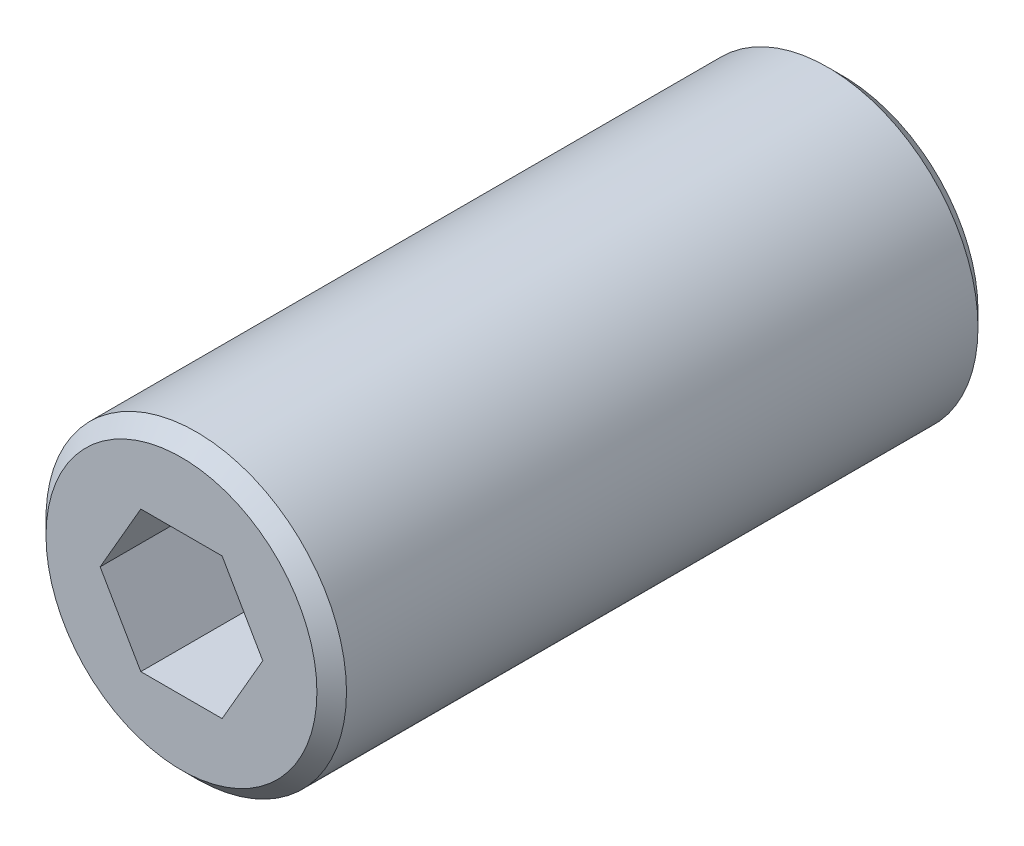
ISO-10303-21;
HEADER;
FILE_DESCRIPTION(('STEP AP214'),'2;1');
FILE_NAME('part.step','',(''),(''),'','','');
FILE_SCHEMA(('AUTOMOTIVE_DESIGN { 1 0 10303 214 1 1 1 1 }'));
ENDSEC;
DATA;
#1=APPLICATION_CONTEXT('core data for automotive mechanical design processes');
#2=APPLICATION_PROTOCOL_DEFINITION('international standard','automotive_design',2000,#1);
#3=PRODUCT_CONTEXT('',#1,'mechanical');
#4=PRODUCT('Part','Part','',(#3));
#5=PRODUCT_RELATED_PRODUCT_CATEGORY('part','',(#4));
#6=PRODUCT_DEFINITION_FORMATION('','',#4);
#7=PRODUCT_DEFINITION_CONTEXT('part definition',#1,'design');
#8=PRODUCT_DEFINITION('design','',#6,#7);
#9=PRODUCT_DEFINITION_SHAPE('','',#8);
#10=(LENGTH_UNIT() NAMED_UNIT(*) SI_UNIT(.MILLI.,.METRE.));
#11=(NAMED_UNIT(*) PLANE_ANGLE_UNIT() SI_UNIT($,.RADIAN.));
#12=(NAMED_UNIT(*) SI_UNIT($,.STERADIAN.) SOLID_ANGLE_UNIT());
#13=UNCERTAINTY_MEASURE_WITH_UNIT(LENGTH_MEASURE(1.E-05),#10,'distance_accuracy_value','');
#14=(GEOMETRIC_REPRESENTATION_CONTEXT(3) GLOBAL_UNCERTAINTY_ASSIGNED_CONTEXT((#13)) GLOBAL_UNIT_ASSIGNED_CONTEXT((#10,
#11,#12)) REPRESENTATION_CONTEXT('',''));
#15=CARTESIAN_POINT('',(0.,0.,0.));
#16=DIRECTION('',(0.,0.,1.));
#17=DIRECTION('',(1.,0.,0.));
#18=AXIS2_PLACEMENT_3D('',#15,#16,#17);
#19=CARTESIAN_POINT('',(0.,0.,44.704));
#20=DIRECTION('',(0.,0.,1.));
#21=DIRECTION('',(1.,0.,0.));
#22=AXIS2_PLACEMENT_3D('',#19,#20,#21);
#23=PLANE('',#22);
#24=CARTESIAN_POINT('',(0.,0.,44.704));
#25=DIRECTION('',(0.,0.,1.));
#26=DIRECTION('',(1.,0.,0.));
#27=AXIS2_PLACEMENT_3D('',#24,#25,#26);
#28=CIRCLE('',#27,9.15999999999999);
#29=CARTESIAN_POINT('',(9.15999999999999,0.,44.704));
#30=VERTEX_POINT('',#29);
#31=EDGE_CURVE('E11',#30,#30,#28,.T.);
#32=ORIENTED_EDGE('',*,*,#31,.T.);
#33=EDGE_LOOP('',(#32));
#34=FACE_BOUND('',#33,.T.);
#35=DIRECTION('',(-0.5,0.866025403784439,0.));
#36=VECTOR('',#35,1.);
#37=CARTESIAN_POINT('',(5.49926131403118,0.,44.704));
#38=LINE('',#37,#36);
#39=CARTESIAN_POINT('',(5.49926131403118,0.,44.704));
#40=VERTEX_POINT('',#39);
#41=CARTESIAN_POINT('',(2.74963065701559,4.76250000000001,44.704));
#42=VERTEX_POINT('',#41);
#43=EDGE_CURVE('E104',#40,#42,#38,.T.);
#44=ORIENTED_EDGE('',*,*,#43,.F.);
#45=DIRECTION('',(0.5,0.866025403784439,0.));
#46=VECTOR('',#45,1.);
#47=CARTESIAN_POINT('',(2.74963065701559,-4.7625,44.704));
#48=LINE('',#47,#46);
#49=CARTESIAN_POINT('',(2.74963065701559,-4.7625,44.704));
#50=VERTEX_POINT('',#49);
#51=EDGE_CURVE('E95',#50,#40,#48,.T.);
#52=ORIENTED_EDGE('',*,*,#51,.F.);
#53=DIRECTION('',(1.,0.,0.));
#54=VECTOR('',#53,1.);
#55=CARTESIAN_POINT('',(-2.74963065701559,-4.7625,44.704));
#56=LINE('',#55,#54);
#57=CARTESIAN_POINT('',(-2.74963065701559,-4.7625,44.704));
#58=VERTEX_POINT('',#57);
#59=EDGE_CURVE('E130',#58,#50,#56,.T.);
#60=ORIENTED_EDGE('',*,*,#59,.F.);
#61=DIRECTION('',(0.5,-0.866025403784439,0.));
#62=VECTOR('',#61,1.);
#63=CARTESIAN_POINT('',(-5.49926131403119,0.,44.704));
#64=LINE('',#63,#62);
#65=CARTESIAN_POINT('',(-5.49926131403119,0.,44.704));
#66=VERTEX_POINT('',#65);
#67=EDGE_CURVE('E127',#66,#58,#64,.T.);
#68=ORIENTED_EDGE('',*,*,#67,.F.);
#69=DIRECTION('',(-0.5,-0.866025403784439,0.));
#70=VECTOR('',#69,1.);
#71=CARTESIAN_POINT('',(-2.74963065701559,4.76250000000001,44.704));
#72=LINE('',#71,#70);
#73=CARTESIAN_POINT('',(-2.74963065701559,4.76250000000001,44.704));
#74=VERTEX_POINT('',#73);
#75=EDGE_CURVE('E122',#74,#66,#72,.T.);
#76=ORIENTED_EDGE('',*,*,#75,.F.);
#77=DIRECTION('',(-1.,0.,0.));
#78=VECTOR('',#77,1.);
#79=CARTESIAN_POINT('',(2.74963065701559,4.76250000000001,44.704));
#80=LINE('',#79,#78);
#81=EDGE_CURVE('E118',#42,#74,#80,.T.);
#82=ORIENTED_EDGE('',*,*,#81,.F.);
#83=EDGE_LOOP('',(#44,#52,#60,#68,#76,#82));
#84=FACE_BOUND('',#83,.T.);
#85=ADVANCED_FACE('F41',(#34,#84),#23,.T.);
#86=CARTESIAN_POINT('',(0.,0.,0.));
#87=DIRECTION('',(0.,0.,1.));
#88=DIRECTION('',(1.,0.,0.));
#89=AXIS2_PLACEMENT_3D('',#86,#87,#88);
#90=PLANE('',#89);
#91=CARTESIAN_POINT('',(0.,0.,0.));
#92=DIRECTION('',(0.,0.,1.));
#93=DIRECTION('',(1.,0.,0.));
#94=AXIS2_PLACEMENT_3D('',#91,#92,#93);
#95=CIRCLE('',#94,9.15999999999999);
#96=CARTESIAN_POINT('',(9.15999999999999,0.,0.));
#97=VERTEX_POINT('',#96);
#98=EDGE_CURVE('E50',#97,#97,#95,.F.);
#99=ORIENTED_EDGE('',*,*,#98,.T.);
#100=EDGE_LOOP('',(#99));
#101=FACE_BOUND('',#100,.T.);
#102=DIRECTION('',(0.5,0.866025403784439,0.));
#103=VECTOR('',#102,1.);
#104=CARTESIAN_POINT('',(2.74963065701559,-4.7625,0.));
#105=LINE('',#104,#103);
#106=CARTESIAN_POINT('',(2.74963065701559,-4.7625,0.));
#107=VERTEX_POINT('',#106);
#108=CARTESIAN_POINT('',(5.49926131403118,0.,0.));
#109=VERTEX_POINT('',#108);
#110=EDGE_CURVE('E65',#107,#109,#105,.T.);
#111=ORIENTED_EDGE('',*,*,#110,.T.);
#112=DIRECTION('',(-0.5,0.866025403784439,0.));
#113=VECTOR('',#112,1.);
#114=CARTESIAN_POINT('',(5.49926131403118,0.,0.));
#115=LINE('',#114,#113);
#116=CARTESIAN_POINT('',(2.74963065701559,4.76250000000001,0.));
#117=VERTEX_POINT('',#116);
#118=EDGE_CURVE('E111',#109,#117,#115,.T.);
#119=ORIENTED_EDGE('',*,*,#118,.T.);
#120=DIRECTION('',(-1.,0.,0.));
#121=VECTOR('',#120,1.);
#122=CARTESIAN_POINT('',(2.74963065701559,4.76250000000001,0.));
#123=LINE('',#122,#121);
#124=CARTESIAN_POINT('',(-2.74963065701559,4.76250000000001,0.));
#125=VERTEX_POINT('',#124);
#126=EDGE_CURVE('E137',#117,#125,#123,.T.);
#127=ORIENTED_EDGE('',*,*,#126,.T.);
#128=DIRECTION('',(-0.5,-0.866025403784439,0.));
#129=VECTOR('',#128,1.);
#130=CARTESIAN_POINT('',(-2.74963065701559,4.76250000000001,0.));
#131=LINE('',#130,#129);
#132=CARTESIAN_POINT('',(-5.49926131403119,0.,0.));
#133=VERTEX_POINT('',#132);
#134=EDGE_CURVE('E141',#125,#133,#131,.T.);
#135=ORIENTED_EDGE('',*,*,#134,.T.);
#136=DIRECTION('',(0.5,-0.866025403784439,0.));
#137=VECTOR('',#136,1.);
#138=CARTESIAN_POINT('',(-5.49926131403119,0.,0.));
#139=LINE('',#138,#137);
#140=CARTESIAN_POINT('',(-2.74963065701559,-4.7625,0.));
#141=VERTEX_POINT('',#140);
#142=EDGE_CURVE('E145',#133,#141,#139,.T.);
#143=ORIENTED_EDGE('',*,*,#142,.T.);
#144=DIRECTION('',(1.,0.,0.));
#145=VECTOR('',#144,1.);
#146=CARTESIAN_POINT('',(-2.74963065701559,-4.7625,0.));
#147=LINE('',#146,#145);
#148=EDGE_CURVE('E105',#141,#107,#147,.T.);
#149=ORIENTED_EDGE('',*,*,#148,.T.);
#150=EDGE_LOOP('',(#111,#119,#127,#135,#143,#149));
#151=FACE_BOUND('',#150,.T.);
#152=ADVANCED_FACE('F174',(#101,#151),#90,.F.);
#153=CARTESIAN_POINT('',(0.,0.,44.704));
#154=DIRECTION('',(0.,0.,-1.));
#155=DIRECTION('',(-1.,0.,0.));
#156=AXIS2_PLACEMENT_3D('',#153,#154,#155);
#157=CYLINDRICAL_SURFACE('',#156,10.16);
#158=CARTESIAN_POINT('',(0.,0.,1.00000000000001));
#159=DIRECTION('',(0.,0.,1.));
#160=DIRECTION('',(1.,0.,0.));
#161=AXIS2_PLACEMENT_3D('',#158,#159,#160);
#162=CIRCLE('',#161,10.16);
#163=CARTESIAN_POINT('',(10.16,0.,1.00000000000001));
#164=VERTEX_POINT('',#163);
#165=EDGE_CURVE('E167',#164,#164,#162,.T.);
#166=ORIENTED_EDGE('',*,*,#165,.T.);
#167=EDGE_LOOP('',(#166));
#168=FACE_BOUND('',#167,.T.);
#169=CARTESIAN_POINT('',(0.,0.,43.704));
#170=DIRECTION('',(0.,0.,1.));
#171=DIRECTION('',(1.,0.,0.));
#172=AXIS2_PLACEMENT_3D('',#169,#170,#171);
#173=CIRCLE('',#172,10.16);
#174=CARTESIAN_POINT('',(10.16,0.,43.704));
#175=VERTEX_POINT('',#174);
#176=EDGE_CURVE('E113',#175,#175,#173,.F.);
#177=ORIENTED_EDGE('',*,*,#176,.T.);
#178=EDGE_LOOP('',(#177));
#179=FACE_BOUND('',#178,.T.);
#180=ADVANCED_FACE('F183',(#168,#179),#157,.T.);
#181=CARTESIAN_POINT('',(2.74963065701559,-4.7625,44.704));
#182=DIRECTION('',(-0.866025403784439,0.5,0.));
#183=DIRECTION('',(-0.5,-0.866025403784439,0.));
#184=AXIS2_PLACEMENT_3D('',#181,#182,#183);
#185=PLANE('',#184);
#186=ORIENTED_EDGE('',*,*,#110,.F.);
#187=DIRECTION('',(0.,0.,-1.));
#188=VECTOR('',#187,1.);
#189=CARTESIAN_POINT('',(2.74963065701559,-4.7625,44.704));
#190=LINE('',#189,#188);
#191=EDGE_CURVE('E99',#50,#107,#190,.T.);
#192=ORIENTED_EDGE('',*,*,#191,.F.);
#193=ORIENTED_EDGE('',*,*,#51,.T.);
#194=DIRECTION('',(0.,0.,-1.));
#195=VECTOR('',#194,1.);
#196=CARTESIAN_POINT('',(5.49926131403118,0.,44.704));
#197=LINE('',#196,#195);
#198=EDGE_CURVE('E98',#40,#109,#197,.T.);
#199=ORIENTED_EDGE('',*,*,#198,.T.);
#200=EDGE_LOOP('',(#186,#192,#193,#199));
#201=FACE_BOUND('',#200,.T.);
#202=ADVANCED_FACE('F97',(#201),#185,.T.);
#203=CARTESIAN_POINT('',(5.49926131403118,0.,44.704));
#204=DIRECTION('',(-0.866025403784439,-0.5,0.));
#205=DIRECTION('',(0.5,-0.866025403784439,0.));
#206=AXIS2_PLACEMENT_3D('',#203,#204,#205);
#207=PLANE('',#206);
#208=ORIENTED_EDGE('',*,*,#118,.F.);
#209=ORIENTED_EDGE('',*,*,#198,.F.);
#210=ORIENTED_EDGE('',*,*,#43,.T.);
#211=DIRECTION('',(0.,0.,-1.));
#212=VECTOR('',#211,1.);
#213=CARTESIAN_POINT('',(2.74963065701559,4.76250000000001,44.704));
#214=LINE('',#213,#212);
#215=EDGE_CURVE('E114',#42,#117,#214,.T.);
#216=ORIENTED_EDGE('',*,*,#215,.T.);
#217=EDGE_LOOP('',(#208,#209,#210,#216));
#218=FACE_BOUND('',#217,.T.);
#219=ADVANCED_FACE('F108',(#218),#207,.T.);
#220=CARTESIAN_POINT('',(2.74963065701559,4.76250000000001,44.704));
#221=DIRECTION('',(0.,-1.,0.));
#222=DIRECTION('',(0.,0.,-1.));
#223=AXIS2_PLACEMENT_3D('',#220,#221,#222);
#224=PLANE('',#223);
#225=ORIENTED_EDGE('',*,*,#126,.F.);
#226=ORIENTED_EDGE('',*,*,#215,.F.);
#227=ORIENTED_EDGE('',*,*,#81,.T.);
#228=DIRECTION('',(0.,0.,-1.));
#229=VECTOR('',#228,1.);
#230=CARTESIAN_POINT('',(-2.74963065701559,4.76250000000001,44.704));
#231=LINE('',#230,#229);
#232=EDGE_CURVE('E159',#74,#125,#231,.T.);
#233=ORIENTED_EDGE('',*,*,#232,.T.);
#234=EDGE_LOOP('',(#225,#226,#227,#233));
#235=FACE_BOUND('',#234,.T.);
#236=ADVANCED_FACE('F204',(#235),#224,.T.);
#237=CARTESIAN_POINT('',(-2.74963065701559,4.76250000000001,44.704));
#238=DIRECTION('',(0.866025403784439,-0.5,0.));
#239=DIRECTION('',(0.5,0.866025403784439,0.));
#240=AXIS2_PLACEMENT_3D('',#237,#238,#239);
#241=PLANE('',#240);
#242=ORIENTED_EDGE('',*,*,#134,.F.);
#243=ORIENTED_EDGE('',*,*,#232,.F.);
#244=ORIENTED_EDGE('',*,*,#75,.T.);
#245=DIRECTION('',(0.,0.,-1.));
#246=VECTOR('',#245,1.);
#247=CARTESIAN_POINT('',(-5.49926131403119,0.,44.704));
#248=LINE('',#247,#246);
#249=EDGE_CURVE('E156',#66,#133,#248,.T.);
#250=ORIENTED_EDGE('',*,*,#249,.T.);
#251=EDGE_LOOP('',(#242,#243,#244,#250));
#252=FACE_BOUND('',#251,.T.);
#253=ADVANCED_FACE('F207',(#252),#241,.T.);
#254=CARTESIAN_POINT('',(-5.49926131403119,0.,44.704));
#255=DIRECTION('',(0.866025403784439,0.5,0.));
#256=DIRECTION('',(-0.5,0.866025403784439,0.));
#257=AXIS2_PLACEMENT_3D('',#254,#255,#256);
#258=PLANE('',#257);
#259=ORIENTED_EDGE('',*,*,#142,.F.);
#260=ORIENTED_EDGE('',*,*,#249,.F.);
#261=ORIENTED_EDGE('',*,*,#67,.T.);
#262=DIRECTION('',(0.,0.,-1.));
#263=VECTOR('',#262,1.);
#264=CARTESIAN_POINT('',(-2.74963065701559,-4.7625,44.704));
#265=LINE('',#264,#263);
#266=EDGE_CURVE('E57',#58,#141,#265,.T.);
#267=ORIENTED_EDGE('',*,*,#266,.T.);
#268=EDGE_LOOP('',(#259,#260,#261,#267));
#269=FACE_BOUND('',#268,.T.);
#270=ADVANCED_FACE('F211',(#269),#258,.T.);
#271=CARTESIAN_POINT('',(-2.74963065701559,-4.7625,44.704));
#272=DIRECTION('',(0.,1.,0.));
#273=DIRECTION('',(-1.,0.,0.));
#274=AXIS2_PLACEMENT_3D('',#271,#272,#273);
#275=PLANE('',#274);
#276=ORIENTED_EDGE('',*,*,#148,.F.);
#277=ORIENTED_EDGE('',*,*,#266,.F.);
#278=ORIENTED_EDGE('',*,*,#59,.T.);
#279=ORIENTED_EDGE('',*,*,#191,.T.);
#280=EDGE_LOOP('',(#276,#277,#278,#279));
#281=FACE_BOUND('',#280,.T.);
#282=ADVANCED_FACE('F180',(#281),#275,.T.);
#283=CARTESIAN_POINT('',(0.,0.,1.00000000000001));
#284=DIRECTION('',(0.,0.,1.));
#285=DIRECTION('',(1.,0.,0.));
#286=AXIS2_PLACEMENT_3D('',#283,#284,#285);
#287=CONICAL_SURFACE('',#286,10.16,0.785398163397447);
#288=ORIENTED_EDGE('',*,*,#98,.F.);
#289=EDGE_LOOP('',(#288));
#290=FACE_BOUND('',#289,.T.);
#291=ORIENTED_EDGE('',*,*,#165,.F.);
#292=EDGE_LOOP('',(#291));
#293=FACE_BOUND('',#292,.T.);
#294=ADVANCED_FACE('F177',(#290,#293),#287,.T.);
#295=CARTESIAN_POINT('',(0.,0.,44.704));
#296=DIRECTION('',(0.,0.,-1.));
#297=DIRECTION('',(-1.,0.,0.));
#298=AXIS2_PLACEMENT_3D('',#295,#296,#297);
#299=CONICAL_SURFACE('',#298,9.15999999999999,0.785398163397447);
#300=ORIENTED_EDGE('',*,*,#176,.F.);
#301=EDGE_LOOP('',(#300));
#302=FACE_BOUND('',#301,.T.);
#303=ORIENTED_EDGE('',*,*,#31,.F.);
#304=EDGE_LOOP('',(#303));
#305=FACE_BOUND('',#304,.T.);
#306=ADVANCED_FACE('F43',(#302,#305),#299,.T.);
#307=CLOSED_SHELL('',(#85,#152,#180,#202,#219,#236,#253,#270,#282,#294,#306));
#308=MANIFOLD_SOLID_BREP('B2',#307);
#309=ADVANCED_BREP_SHAPE_REPRESENTATION('',(#18,#308),#14);
#310=SHAPE_DEFINITION_REPRESENTATION(#9,#309);
ENDSEC;
END-ISO-10303-21;
